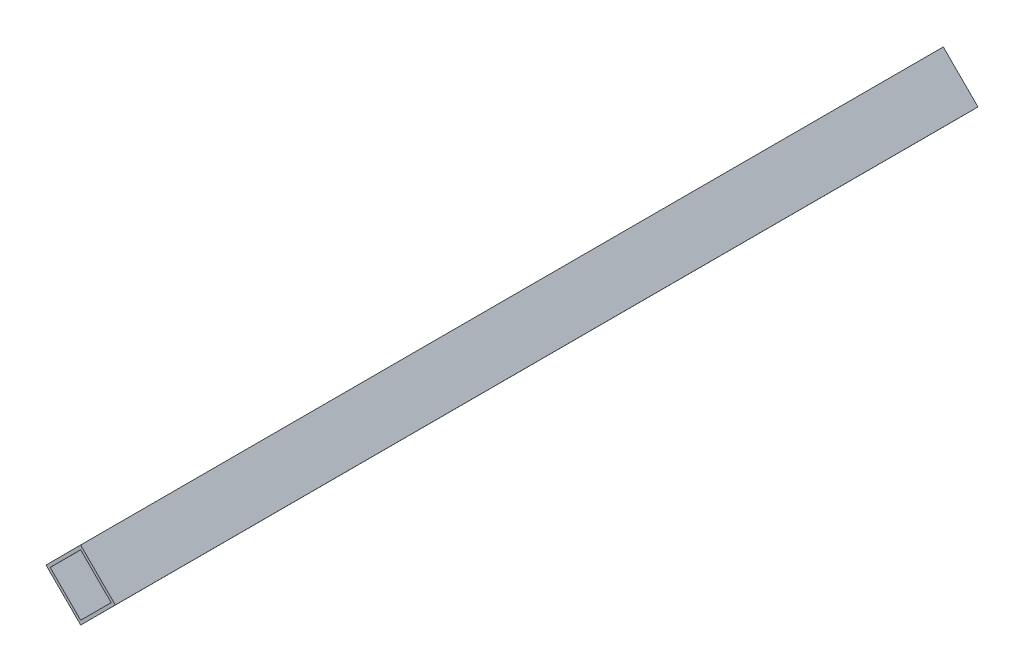
ISO-10303-21;
HEADER;
FILE_DESCRIPTION(('STEP AP214'),'2;1');
FILE_NAME('part.step','',(''),(''),'','','');
FILE_SCHEMA(('AUTOMOTIVE_DESIGN { 1 0 10303 214 1 1 1 1 }'));
ENDSEC;
DATA;
#1=APPLICATION_CONTEXT('core data for automotive mechanical design processes');
#2=APPLICATION_PROTOCOL_DEFINITION('international standard','automotive_design',2000,#1);
#3=PRODUCT_CONTEXT('',#1,'mechanical');
#4=PRODUCT('Part','Part','',(#3));
#5=PRODUCT_RELATED_PRODUCT_CATEGORY('part','',(#4));
#6=PRODUCT_DEFINITION_FORMATION('','',#4);
#7=PRODUCT_DEFINITION_CONTEXT('part definition',#1,'design');
#8=PRODUCT_DEFINITION('design','',#6,#7);
#9=PRODUCT_DEFINITION_SHAPE('','',#8);
#10=(LENGTH_UNIT() NAMED_UNIT(*) SI_UNIT(.MILLI.,.METRE.));
#11=(NAMED_UNIT(*) PLANE_ANGLE_UNIT() SI_UNIT($,.RADIAN.));
#12=(NAMED_UNIT(*) SI_UNIT($,.STERADIAN.) SOLID_ANGLE_UNIT());
#13=UNCERTAINTY_MEASURE_WITH_UNIT(LENGTH_MEASURE(1.E-05),#10,'distance_accuracy_value','');
#14=(GEOMETRIC_REPRESENTATION_CONTEXT(3) GLOBAL_UNCERTAINTY_ASSIGNED_CONTEXT((#13)) GLOBAL_UNIT_ASSIGNED_CONTEXT((#10,
#11,#12)) REPRESENTATION_CONTEXT('',''));
#15=CARTESIAN_POINT('',(0.,0.,0.));
#16=DIRECTION('',(0.,0.,1.));
#17=DIRECTION('',(1.,0.,0.));
#18=AXIS2_PLACEMENT_3D('',#15,#16,#17);
#19=CARTESIAN_POINT('',(0.,0.,440.));
#20=DIRECTION('',(0.,0.,1.));
#21=DIRECTION('',(1.,0.,0.));
#22=AXIS2_PLACEMENT_3D('',#19,#20,#21);
#23=PLANE('',#22);
#24=DIRECTION('',(-0.70646122875546,-0.707751744798503,0.));
#25=VECTOR('',#24,1.);
#26=CARTESIAN_POINT('',(0.,0.,440.));
#27=LINE('',#26,#25);
#28=CARTESIAN_POINT('',(0.,0.,440.));
#29=VERTEX_POINT('',#28);
#30=CARTESIAN_POINT('',(-17.6615307188865,-17.6937936199626,440.));
#31=VERTEX_POINT('',#30);
#32=EDGE_CURVE('E153',#29,#31,#27,.T.);
#33=ORIENTED_EDGE('',*,*,#32,.T.);
#34=DIRECTION('',(0.707751744798503,-0.70646122875546,0.));
#35=VECTOR('',#34,1.);
#36=CARTESIAN_POINT('',(-17.6615307188865,-17.6937936199626,440.));
#37=LINE('',#36,#35);
#38=CARTESIAN_POINT('',(0.0322629010760627,-35.3553243388491,440.));
#39=VERTEX_POINT('',#38);
#40=EDGE_CURVE('E157',#31,#39,#37,.T.);
#41=ORIENTED_EDGE('',*,*,#40,.T.);
#42=DIRECTION('',(0.70646122875546,0.707751744798503,0.));
#43=VECTOR('',#42,1.);
#44=CARTESIAN_POINT('',(17.6937936199626,-17.6615307188865,440.));
#45=LINE('',#44,#43);
#46=CARTESIAN_POINT('',(17.6937936199626,-17.6615307188865,440.));
#47=VERTEX_POINT('',#46);
#48=EDGE_CURVE('E161',#39,#47,#45,.T.);
#49=ORIENTED_EDGE('',*,*,#48,.T.);
#50=DIRECTION('',(-0.707751744798503,0.70646122875546,0.));
#51=VECTOR('',#50,1.);
#52=CARTESIAN_POINT('',(0.,0.,440.));
#53=LINE('',#52,#51);
#54=EDGE_CURVE('E164',#47,#29,#53,.T.);
#55=ORIENTED_EDGE('',*,*,#54,.T.);
#56=EDGE_LOOP('',(#33,#41,#49,#55));
#57=FACE_BOUND('',#56,.T.);
#58=DIRECTION('',(-0.706461228755461,-0.707751744798503,0.));
#59=VECTOR('',#58,1.);
#60=CARTESIAN_POINT('',(0.00193577406456353,-2.12131946033095,440.));
#61=LINE('',#60,#59);
#62=CARTESIAN_POINT('',(0.00193577406456353,-2.12131946033095,440.));
#63=VERTEX_POINT('',#62);
#64=CARTESIAN_POINT('',(-15.5402112585556,-17.691857845898,440.));
#65=VERTEX_POINT('',#64);
#66=EDGE_CURVE('E114',#63,#65,#61,.T.);
#67=ORIENTED_EDGE('',*,*,#66,.F.);
#68=DIRECTION('',(-0.707751744798503,0.70646122875546,0.));
#69=VECTOR('',#68,1.);
#70=CARTESIAN_POINT('',(0.00193577406456353,-2.12131946033095,440.));
#71=LINE('',#70,#69);
#72=CARTESIAN_POINT('',(15.5724741596316,-17.6634664929511,440.));
#73=VERTEX_POINT('',#72);
#74=EDGE_CURVE('E105',#73,#63,#71,.T.);
#75=ORIENTED_EDGE('',*,*,#74,.F.);
#76=DIRECTION('',(0.70646122875546,0.707751744798503,0.));
#77=VECTOR('',#76,1.);
#78=CARTESIAN_POINT('',(15.5724741596316,-17.6634664929511,440.));
#79=LINE('',#78,#77);
#80=CARTESIAN_POINT('',(0.0303271270114987,-33.2340048785181,440.));
#81=VERTEX_POINT('',#80);
#82=EDGE_CURVE('E131',#81,#73,#79,.T.);
#83=ORIENTED_EDGE('',*,*,#82,.F.);
#84=DIRECTION('',(0.707751744798503,-0.70646122875546,0.));
#85=VECTOR('',#84,1.);
#86=CARTESIAN_POINT('',(-15.5402112585556,-17.691857845898,440.));
#87=LINE('',#86,#85);
#88=EDGE_CURVE('E127',#65,#81,#87,.T.);
#89=ORIENTED_EDGE('',*,*,#88,.F.);
#90=EDGE_LOOP('',(#67,#75,#83,#89));
#91=FACE_BOUND('',#90,.T.);
#92=ADVANCED_FACE('F39',(#57,#91),#23,.T.);
#93=CARTESIAN_POINT('',(0.,0.,0.));
#94=DIRECTION('',(0.,0.,1.));
#95=DIRECTION('',(1.,0.,0.));
#96=AXIS2_PLACEMENT_3D('',#93,#94,#95);
#97=PLANE('',#96);
#98=DIRECTION('',(-0.70646122875546,-0.707751744798503,0.));
#99=VECTOR('',#98,1.);
#100=CARTESIAN_POINT('',(0.,0.,0.));
#101=LINE('',#100,#99);
#102=CARTESIAN_POINT('',(0.,0.,0.));
#103=VERTEX_POINT('',#102);
#104=CARTESIAN_POINT('',(-17.6615307188865,-17.6937936199626,0.));
#105=VERTEX_POINT('',#104);
#106=EDGE_CURVE('E123',#103,#105,#101,.T.);
#107=ORIENTED_EDGE('',*,*,#106,.F.);
#108=DIRECTION('',(-0.707751744798503,0.70646122875546,0.));
#109=VECTOR('',#108,1.);
#110=CARTESIAN_POINT('',(0.,0.,0.));
#111=LINE('',#110,#109);
#112=CARTESIAN_POINT('',(17.6937936199626,-17.6615307188865,0.));
#113=VERTEX_POINT('',#112);
#114=EDGE_CURVE('E158',#113,#103,#111,.T.);
#115=ORIENTED_EDGE('',*,*,#114,.F.);
#116=DIRECTION('',(0.70646122875546,0.707751744798503,0.));
#117=VECTOR('',#116,1.);
#118=CARTESIAN_POINT('',(17.6937936199626,-17.6615307188865,0.));
#119=LINE('',#118,#117);
#120=CARTESIAN_POINT('',(0.0322629010760627,-35.3553243388491,0.));
#121=VERTEX_POINT('',#120);
#122=EDGE_CURVE('E174',#121,#113,#119,.T.);
#123=ORIENTED_EDGE('',*,*,#122,.F.);
#124=DIRECTION('',(0.707751744798503,-0.70646122875546,0.));
#125=VECTOR('',#124,1.);
#126=CARTESIAN_POINT('',(-17.6615307188865,-17.6937936199626,0.));
#127=LINE('',#126,#125);
#128=EDGE_CURVE('E171',#105,#121,#127,.T.);
#129=ORIENTED_EDGE('',*,*,#128,.F.);
#130=EDGE_LOOP('',(#107,#115,#123,#129));
#131=FACE_BOUND('',#130,.T.);
#132=DIRECTION('',(-0.707751744798503,0.70646122875546,0.));
#133=VECTOR('',#132,1.);
#134=CARTESIAN_POINT('',(0.00193577406456353,-2.12131946033095,0.));
#135=LINE('',#134,#133);
#136=CARTESIAN_POINT('',(15.5724741596316,-17.6634664929511,0.));
#137=VERTEX_POINT('',#136);
#138=CARTESIAN_POINT('',(0.00193577406456353,-2.12131946033095,0.));
#139=VERTEX_POINT('',#138);
#140=EDGE_CURVE('E63',#137,#139,#135,.T.);
#141=ORIENTED_EDGE('',*,*,#140,.T.);
#142=DIRECTION('',(-0.706461228755461,-0.707751744798503,0.));
#143=VECTOR('',#142,1.);
#144=CARTESIAN_POINT('',(0.00193577406456353,-2.12131946033095,0.));
#145=LINE('',#144,#143);
#146=CARTESIAN_POINT('',(-15.5402112585556,-17.691857845898,0.));
#147=VERTEX_POINT('',#146);
#148=EDGE_CURVE('E121',#139,#147,#145,.T.);
#149=ORIENTED_EDGE('',*,*,#148,.T.);
#150=DIRECTION('',(0.707751744798503,-0.70646122875546,0.));
#151=VECTOR('',#150,1.);
#152=CARTESIAN_POINT('',(-15.5402112585556,-17.691857845898,0.));
#153=LINE('',#152,#151);
#154=CARTESIAN_POINT('',(0.0303271270114987,-33.2340048785181,0.));
#155=VERTEX_POINT('',#154);
#156=EDGE_CURVE('E140',#147,#155,#153,.T.);
#157=ORIENTED_EDGE('',*,*,#156,.T.);
#158=DIRECTION('',(0.70646122875546,0.707751744798503,0.));
#159=VECTOR('',#158,1.);
#160=CARTESIAN_POINT('',(15.5724741596316,-17.6634664929511,0.));
#161=LINE('',#160,#159);
#162=EDGE_CURVE('E115',#155,#137,#161,.T.);
#163=ORIENTED_EDGE('',*,*,#162,.T.);
#164=EDGE_LOOP('',(#141,#149,#157,#163));
#165=FACE_BOUND('',#164,.T.);
#166=ADVANCED_FACE('F197',(#131,#165),#97,.F.);
#167=CARTESIAN_POINT('',(0.,0.,440.));
#168=DIRECTION('',(0.707751744798503,-0.70646122875546,0.));
#169=DIRECTION('',(0.70646122875546,0.707751744798503,0.));
#170=AXIS2_PLACEMENT_3D('',#167,#168,#169);
#171=PLANE('',#170);
#172=ORIENTED_EDGE('',*,*,#106,.T.);
#173=DIRECTION('',(0.,0.,-1.));
#174=VECTOR('',#173,1.);
#175=CARTESIAN_POINT('',(-17.6615307188865,-17.6937936199626,440.));
#176=LINE('',#175,#174);
#177=EDGE_CURVE('E11',#31,#105,#176,.T.);
#178=ORIENTED_EDGE('',*,*,#177,.F.);
#179=ORIENTED_EDGE('',*,*,#32,.F.);
#180=DIRECTION('',(0.,0.,-1.));
#181=VECTOR('',#180,1.);
#182=CARTESIAN_POINT('',(0.,0.,440.));
#183=LINE('',#182,#181);
#184=EDGE_CURVE('E167',#29,#103,#183,.T.);
#185=ORIENTED_EDGE('',*,*,#184,.T.);
#186=EDGE_LOOP('',(#172,#178,#179,#185));
#187=FACE_BOUND('',#186,.T.);
#188=ADVANCED_FACE('F41',(#187),#171,.F.);
#189=CARTESIAN_POINT('',(-17.6615307188865,-17.6937936199626,440.));
#190=DIRECTION('',(0.70646122875546,0.707751744798503,0.));
#191=DIRECTION('',(-0.707751744798503,0.70646122875546,0.));
#192=AXIS2_PLACEMENT_3D('',#189,#190,#191);
#193=PLANE('',#192);
#194=ORIENTED_EDGE('',*,*,#128,.T.);
#195=DIRECTION('',(0.,0.,-1.));
#196=VECTOR('',#195,1.);
#197=CARTESIAN_POINT('',(0.0322629010760627,-35.3553243388491,440.));
#198=LINE('',#197,#196);
#199=EDGE_CURVE('E48',#39,#121,#198,.T.);
#200=ORIENTED_EDGE('',*,*,#199,.F.);
#201=ORIENTED_EDGE('',*,*,#40,.F.);
#202=ORIENTED_EDGE('',*,*,#177,.T.);
#203=EDGE_LOOP('',(#194,#200,#201,#202));
#204=FACE_BOUND('',#203,.T.);
#205=ADVANCED_FACE('F207',(#204),#193,.F.);
#206=CARTESIAN_POINT('',(17.6937936199626,-17.6615307188865,440.));
#207=DIRECTION('',(-0.707751744798503,0.70646122875546,0.));
#208=DIRECTION('',(-0.70646122875546,-0.707751744798503,0.));
#209=AXIS2_PLACEMENT_3D('',#206,#207,#208);
#210=PLANE('',#209);
#211=ORIENTED_EDGE('',*,*,#122,.T.);
#212=DIRECTION('',(0.,0.,-1.));
#213=VECTOR('',#212,1.);
#214=CARTESIAN_POINT('',(17.6937936199626,-17.6615307188865,440.));
#215=LINE('',#214,#213);
#216=EDGE_CURVE('E182',#47,#113,#215,.T.);
#217=ORIENTED_EDGE('',*,*,#216,.F.);
#218=ORIENTED_EDGE('',*,*,#48,.F.);
#219=ORIENTED_EDGE('',*,*,#199,.T.);
#220=EDGE_LOOP('',(#211,#217,#218,#219));
#221=FACE_BOUND('',#220,.T.);
#222=ADVANCED_FACE('F191',(#221),#210,.F.);
#223=CARTESIAN_POINT('',(0.,0.,440.));
#224=DIRECTION('',(-0.70646122875546,-0.707751744798503,0.));
#225=DIRECTION('',(0.707751744798503,-0.70646122875546,0.));
#226=AXIS2_PLACEMENT_3D('',#223,#224,#225);
#227=PLANE('',#226);
#228=ORIENTED_EDGE('',*,*,#114,.T.);
#229=ORIENTED_EDGE('',*,*,#184,.F.);
#230=ORIENTED_EDGE('',*,*,#54,.F.);
#231=ORIENTED_EDGE('',*,*,#216,.T.);
#232=EDGE_LOOP('',(#228,#229,#230,#231));
#233=FACE_BOUND('',#232,.T.);
#234=ADVANCED_FACE('F201',(#233),#227,.F.);
#235=CARTESIAN_POINT('',(0.00193577406456353,-2.12131946033095,440.));
#236=DIRECTION('',(-0.70646122875546,-0.707751744798503,0.));
#237=DIRECTION('',(0.707751744798503,-0.70646122875546,0.));
#238=AXIS2_PLACEMENT_3D('',#235,#236,#237);
#239=PLANE('',#238);
#240=ORIENTED_EDGE('',*,*,#140,.F.);
#241=DIRECTION('',(0.,0.,-1.));
#242=VECTOR('',#241,1.);
#243=CARTESIAN_POINT('',(15.5724741596316,-17.6634664929511,440.));
#244=LINE('',#243,#242);
#245=EDGE_CURVE('E109',#73,#137,#244,.T.);
#246=ORIENTED_EDGE('',*,*,#245,.F.);
#247=ORIENTED_EDGE('',*,*,#74,.T.);
#248=DIRECTION('',(0.,0.,-1.));
#249=VECTOR('',#248,1.);
#250=CARTESIAN_POINT('',(0.00193577406456353,-2.12131946033095,440.));
#251=LINE('',#250,#249);
#252=EDGE_CURVE('E108',#63,#139,#251,.T.);
#253=ORIENTED_EDGE('',*,*,#252,.T.);
#254=EDGE_LOOP('',(#240,#246,#247,#253));
#255=FACE_BOUND('',#254,.T.);
#256=ADVANCED_FACE('F107',(#255),#239,.T.);
#257=CARTESIAN_POINT('',(0.00193577406456353,-2.12131946033095,440.));
#258=DIRECTION('',(0.707751744798503,-0.70646122875546,0.));
#259=DIRECTION('',(0.706461228755461,0.707751744798503,0.));
#260=AXIS2_PLACEMENT_3D('',#257,#258,#259);
#261=PLANE('',#260);
#262=ORIENTED_EDGE('',*,*,#148,.F.);
#263=ORIENTED_EDGE('',*,*,#252,.F.);
#264=ORIENTED_EDGE('',*,*,#66,.T.);
#265=DIRECTION('',(0.,0.,-1.));
#266=VECTOR('',#265,1.);
#267=CARTESIAN_POINT('',(-15.5402112585556,-17.691857845898,440.));
#268=LINE('',#267,#266);
#269=EDGE_CURVE('E124',#65,#147,#268,.T.);
#270=ORIENTED_EDGE('',*,*,#269,.T.);
#271=EDGE_LOOP('',(#262,#263,#264,#270));
#272=FACE_BOUND('',#271,.T.);
#273=ADVANCED_FACE('F118',(#272),#261,.T.);
#274=CARTESIAN_POINT('',(-15.5402112585556,-17.691857845898,440.));
#275=DIRECTION('',(0.70646122875546,0.707751744798503,0.));
#276=DIRECTION('',(-0.707751744798503,0.70646122875546,0.));
#277=AXIS2_PLACEMENT_3D('',#274,#275,#276);
#278=PLANE('',#277);
#279=ORIENTED_EDGE('',*,*,#156,.F.);
#280=ORIENTED_EDGE('',*,*,#269,.F.);
#281=ORIENTED_EDGE('',*,*,#88,.T.);
#282=DIRECTION('',(0.,0.,-1.));
#283=VECTOR('',#282,1.);
#284=CARTESIAN_POINT('',(0.0303271270114987,-33.2340048785181,440.));
#285=LINE('',#284,#283);
#286=EDGE_CURVE('E55',#81,#155,#285,.T.);
#287=ORIENTED_EDGE('',*,*,#286,.T.);
#288=EDGE_LOOP('',(#279,#280,#281,#287));
#289=FACE_BOUND('',#288,.T.);
#290=ADVANCED_FACE('F230',(#289),#278,.T.);
#291=CARTESIAN_POINT('',(15.5724741596316,-17.6634664929511,440.));
#292=DIRECTION('',(-0.707751744798503,0.70646122875546,0.));
#293=DIRECTION('',(-0.70646122875546,-0.707751744798503,0.));
#294=AXIS2_PLACEMENT_3D('',#291,#292,#293);
#295=PLANE('',#294);
#296=ORIENTED_EDGE('',*,*,#162,.F.);
#297=ORIENTED_EDGE('',*,*,#286,.F.);
#298=ORIENTED_EDGE('',*,*,#82,.T.);
#299=ORIENTED_EDGE('',*,*,#245,.T.);
#300=EDGE_LOOP('',(#296,#297,#298,#299));
#301=FACE_BOUND('',#300,.T.);
#302=ADVANCED_FACE('F234',(#301),#295,.T.);
#303=CLOSED_SHELL('',(#92,#166,#188,#205,#222,#234,#256,#273,#290,#302));
#304=MANIFOLD_SOLID_BREP('B2',#303);
#305=ADVANCED_BREP_SHAPE_REPRESENTATION('',(#18,#304),#14);
#306=SHAPE_DEFINITION_REPRESENTATION(#9,#305);
ENDSEC;
END-ISO-10303-21;
